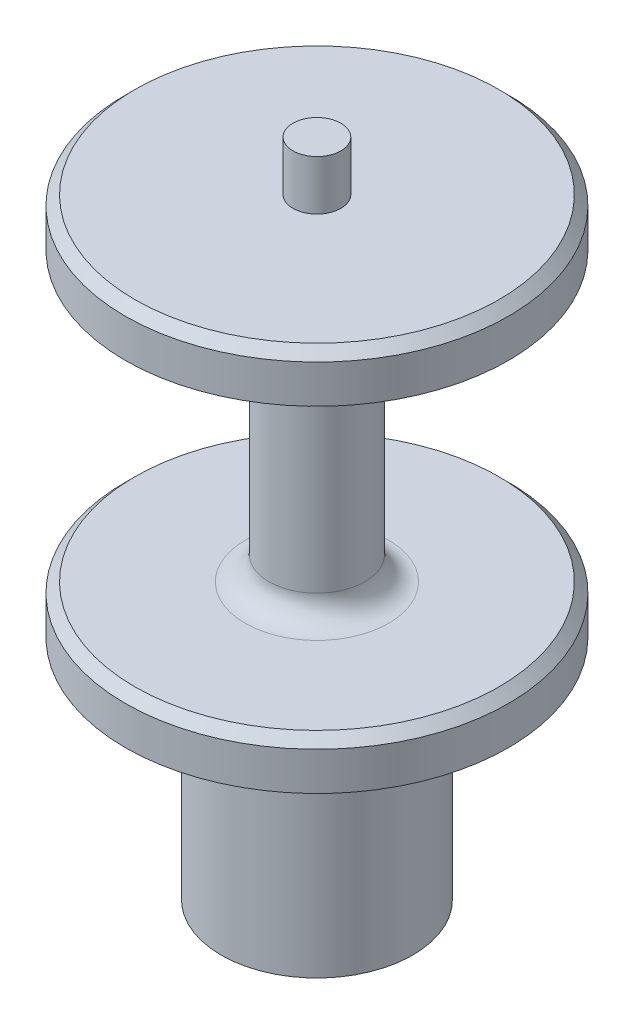
ISO-10303-21;
HEADER;
FILE_DESCRIPTION(('STEP AP214'),'2;1');
FILE_NAME('part.step','',(''),(''),'','','');
FILE_SCHEMA(('AUTOMOTIVE_DESIGN { 1 0 10303 214 1 1 1 1 }'));
ENDSEC;
DATA;
#1=APPLICATION_CONTEXT('core data for automotive mechanical design processes');
#2=APPLICATION_PROTOCOL_DEFINITION('international standard','automotive_design',2000,#1);
#3=PRODUCT_CONTEXT('',#1,'mechanical');
#4=PRODUCT('Part','Part','',(#3));
#5=PRODUCT_RELATED_PRODUCT_CATEGORY('part','',(#4));
#6=PRODUCT_DEFINITION_FORMATION('','',#4);
#7=PRODUCT_DEFINITION_CONTEXT('part definition',#1,'design');
#8=PRODUCT_DEFINITION('design','',#6,#7);
#9=PRODUCT_DEFINITION_SHAPE('','',#8);
#10=(LENGTH_UNIT() NAMED_UNIT(*) SI_UNIT(.MILLI.,.METRE.));
#11=(NAMED_UNIT(*) PLANE_ANGLE_UNIT() SI_UNIT($,.RADIAN.));
#12=(NAMED_UNIT(*) SI_UNIT($,.STERADIAN.) SOLID_ANGLE_UNIT());
#13=UNCERTAINTY_MEASURE_WITH_UNIT(LENGTH_MEASURE(1.E-05),#10,'distance_accuracy_value','');
#14=(GEOMETRIC_REPRESENTATION_CONTEXT(3) GLOBAL_UNCERTAINTY_ASSIGNED_CONTEXT((#13)) GLOBAL_UNIT_ASSIGNED_CONTEXT((#10,
#11,#12)) REPRESENTATION_CONTEXT('',''));
#15=CARTESIAN_POINT('',(0.,0.,0.));
#16=DIRECTION('',(0.,0.,1.));
#17=DIRECTION('',(1.,0.,0.));
#18=AXIS2_PLACEMENT_3D('',#15,#16,#17);
#19=CARTESIAN_POINT('',(0.,80.9625,0.));
#20=DIRECTION('',(0.,-1.,0.));
#21=DIRECTION('',(0.,0.,-1.));
#22=AXIS2_PLACEMENT_3D('',#19,#20,#21);
#23=CYLINDRICAL_SURFACE('',#22,25.4);
#24=CARTESIAN_POINT('',(0.,35.2425,0.));
#25=DIRECTION('',(0.,1.,0.));
#26=DIRECTION('',(0.,0.,1.));
#27=AXIS2_PLACEMENT_3D('',#24,#25,#26);
#28=CIRCLE('',#27,25.4);
#29=CARTESIAN_POINT('',(0.,35.2425,25.4));
#30=VERTEX_POINT('',#29);
#31=EDGE_CURVE('E11',#30,#30,#28,.F.);
#32=ORIENTED_EDGE('',*,*,#31,.T.);
#33=EDGE_LOOP('',(#32));
#34=FACE_BOUND('',#33,.T.);
#35=CARTESIAN_POINT('',(0.,30.1625,0.));
#36=DIRECTION('',(0.,1.,0.));
#37=DIRECTION('',(0.,0.,1.));
#38=AXIS2_PLACEMENT_3D('',#35,#36,#37);
#39=CIRCLE('',#38,25.4);
#40=CARTESIAN_POINT('',(0.,30.1625,25.4));
#41=VERTEX_POINT('',#40);
#42=EDGE_CURVE('E297',#41,#41,#39,.T.);
#43=ORIENTED_EDGE('',*,*,#42,.T.);
#44=EDGE_LOOP('',(#43));
#45=FACE_BOUND('',#44,.T.);
#46=ADVANCED_FACE('F35',(#34,#45),#23,.T.);
#47=CARTESIAN_POINT('',(0.,0.,0.));
#48=DIRECTION('',(0.,1.,0.));
#49=DIRECTION('',(0.,0.,1.));
#50=AXIS2_PLACEMENT_3D('',#47,#48,#49);
#51=PLANE('',#50);
#52=CARTESIAN_POINT('',(0.,0.,0.));
#53=DIRECTION('',(0.,1.,0.));
#54=DIRECTION('',(0.,0.,1.));
#55=AXIS2_PLACEMENT_3D('',#52,#53,#54);
#56=CIRCLE('',#55,12.7);
#57=CARTESIAN_POINT('',(0.,0.,12.7));
#58=VERTEX_POINT('',#57);
#59=EDGE_CURVE('E341',#58,#58,#56,.T.);
#60=ORIENTED_EDGE('',*,*,#59,.F.);
#61=EDGE_LOOP('',(#60));
#62=FACE_BOUND('',#61,.T.);
#63=DIRECTION('',(0.707106781186548,0.,0.707106781186547));
#64=VECTOR('',#63,1.);
#65=CARTESIAN_POINT('',(-4.94974746830584,0.,4.94974746830584));
#66=LINE('',#65,#64);
#67=CARTESIAN_POINT('',(-8.77696292147802,0.,1.12253201513365));
#68=VERTEX_POINT('',#67);
#69=CARTESIAN_POINT('',(-7.,0.,2.89949493661167));
#70=VERTEX_POINT('',#69);
#71=EDGE_CURVE('E50',#68,#70,#66,.T.);
#72=ORIENTED_EDGE('',*,*,#71,.T.);
#73=DIRECTION('',(0.,0.,1.));
#74=VECTOR('',#73,1.);
#75=CARTESIAN_POINT('',(-7.,0.,0.));
#76=LINE('',#75,#74);
#77=CARTESIAN_POINT('',(-7.,0.,5.4125));
#78=VERTEX_POINT('',#77);
#79=EDGE_CURVE('E136',#70,#78,#76,.T.);
#80=ORIENTED_EDGE('',*,*,#79,.T.);
#81=CARTESIAN_POINT('',(-5.4125,0.,5.4125));
#82=DIRECTION('',(0.,-1.,0.));
#83=DIRECTION('',(0.,0.,-1.));
#84=AXIS2_PLACEMENT_3D('',#81,#82,#83);
#85=CIRCLE('',#84,1.5875);
#86=CARTESIAN_POINT('',(-5.4125,0.,7.));
#87=VERTEX_POINT('',#86);
#88=EDGE_CURVE('E291',#87,#78,#85,.T.);
#89=ORIENTED_EDGE('',*,*,#88,.F.);
#90=DIRECTION('',(1.,0.,0.));
#91=VECTOR('',#90,1.);
#92=CARTESIAN_POINT('',(0.,0.,7.));
#93=LINE('',#92,#91);
#94=CARTESIAN_POINT('',(-2.89949493661167,0.,7.));
#95=VERTEX_POINT('',#94);
#96=EDGE_CURVE('E208',#87,#95,#93,.T.);
#97=ORIENTED_EDGE('',*,*,#96,.T.);
#98=DIRECTION('',(0.707106781186548,0.,0.707106781186547));
#99=VECTOR('',#98,1.);
#100=CARTESIAN_POINT('',(-4.94974746830584,0.,4.94974746830584));
#101=LINE('',#100,#99);
#102=CARTESIAN_POINT('',(-1.12253201513365,0.,8.77696292147802));
#103=VERTEX_POINT('',#102);
#104=EDGE_CURVE('E287',#95,#103,#101,.T.);
#105=ORIENTED_EDGE('',*,*,#104,.T.);
#106=CARTESIAN_POINT('',(0.,0.,7.65443090634438));
#107=DIRECTION('',(0.,-1.,0.));
#108=DIRECTION('',(0.,0.,-1.));
#109=AXIS2_PLACEMENT_3D('',#106,#107,#108);
#110=CIRCLE('',#109,1.5875);
#111=CARTESIAN_POINT('',(1.12253201513365,0.,8.77696292147801));
#112=VERTEX_POINT('',#111);
#113=EDGE_CURVE('E284',#112,#103,#110,.T.);
#114=ORIENTED_EDGE('',*,*,#113,.F.);
#115=DIRECTION('',(0.707106781186548,0.,-0.707106781186548));
#116=VECTOR('',#115,1.);
#117=CARTESIAN_POINT('',(4.94974746830583,0.,4.94974746830583));
#118=LINE('',#117,#116);
#119=CARTESIAN_POINT('',(2.89949493661166,0.,7.));
#120=VERTEX_POINT('',#119);
#121=EDGE_CURVE('E281',#112,#120,#118,.T.);
#122=ORIENTED_EDGE('',*,*,#121,.T.);
#123=DIRECTION('',(1.,0.,0.));
#124=VECTOR('',#123,1.);
#125=CARTESIAN_POINT('',(0.,0.,7.));
#126=LINE('',#125,#124);
#127=CARTESIAN_POINT('',(5.4125,0.,7.));
#128=VERTEX_POINT('',#127);
#129=EDGE_CURVE('E278',#120,#128,#126,.T.);
#130=ORIENTED_EDGE('',*,*,#129,.T.);
#131=CARTESIAN_POINT('',(5.4125,0.,5.4125));
#132=DIRECTION('',(0.,-1.,0.));
#133=DIRECTION('',(0.,0.,-1.));
#134=AXIS2_PLACEMENT_3D('',#131,#132,#133);
#135=CIRCLE('',#134,1.5875);
#136=CARTESIAN_POINT('',(7.,0.,5.4125));
#137=VERTEX_POINT('',#136);
#138=EDGE_CURVE('E275',#137,#128,#135,.T.);
#139=ORIENTED_EDGE('',*,*,#138,.F.);
#140=DIRECTION('',(0.,0.,1.));
#141=VECTOR('',#140,1.);
#142=CARTESIAN_POINT('',(7.,0.,0.));
#143=LINE('',#142,#141);
#144=CARTESIAN_POINT('',(7.,0.,2.89949493661167));
#145=VERTEX_POINT('',#144);
#146=EDGE_CURVE('E272',#145,#137,#143,.T.);
#147=ORIENTED_EDGE('',*,*,#146,.F.);
#148=DIRECTION('',(0.707106781186548,0.,-0.707106781186548));
#149=VECTOR('',#148,1.);
#150=CARTESIAN_POINT('',(4.94974746830583,0.,4.94974746830583));
#151=LINE('',#150,#149);
#152=CARTESIAN_POINT('',(8.77696292147802,0.,1.12253201513365));
#153=VERTEX_POINT('',#152);
#154=EDGE_CURVE('E269',#145,#153,#151,.T.);
#155=ORIENTED_EDGE('',*,*,#154,.T.);
#156=CARTESIAN_POINT('',(7.65443090634438,0.,0.));
#157=DIRECTION('',(0.,-1.,0.));
#158=DIRECTION('',(0.,0.,-1.));
#159=AXIS2_PLACEMENT_3D('',#156,#157,#158);
#160=CIRCLE('',#159,1.5875);
#161=CARTESIAN_POINT('',(8.77696292147801,0.,-1.12253201513364));
#162=VERTEX_POINT('',#161);
#163=EDGE_CURVE('E266',#162,#153,#160,.T.);
#164=ORIENTED_EDGE('',*,*,#163,.F.);
#165=DIRECTION('',(0.707106781186548,0.,0.707106781186548));
#166=VECTOR('',#165,1.);
#167=CARTESIAN_POINT('',(4.94974746830583,0.,-4.94974746830583));
#168=LINE('',#167,#166);
#169=CARTESIAN_POINT('',(7.,0.,-2.89949493661165));
#170=VERTEX_POINT('',#169);
#171=EDGE_CURVE('E263',#170,#162,#168,.T.);
#172=ORIENTED_EDGE('',*,*,#171,.F.);
#173=DIRECTION('',(0.,0.,1.));
#174=VECTOR('',#173,1.);
#175=CARTESIAN_POINT('',(7.,0.,0.));
#176=LINE('',#175,#174);
#177=CARTESIAN_POINT('',(7.,0.,-5.4125));
#178=VERTEX_POINT('',#177);
#179=EDGE_CURVE('E260',#178,#170,#176,.T.);
#180=ORIENTED_EDGE('',*,*,#179,.F.);
#181=CARTESIAN_POINT('',(5.4125,0.,-5.4125));
#182=DIRECTION('',(0.,-1.,0.));
#183=DIRECTION('',(0.,0.,-1.));
#184=AXIS2_PLACEMENT_3D('',#181,#182,#183);
#185=CIRCLE('',#184,1.5875);
#186=CARTESIAN_POINT('',(5.4125,0.,-7.));
#187=VERTEX_POINT('',#186);
#188=EDGE_CURVE('E257',#187,#178,#185,.T.);
#189=ORIENTED_EDGE('',*,*,#188,.F.);
#190=DIRECTION('',(1.,0.,0.));
#191=VECTOR('',#190,1.);
#192=CARTESIAN_POINT('',(0.,0.,-7.));
#193=LINE('',#192,#191);
#194=CARTESIAN_POINT('',(2.89949493661166,0.,-7.));
#195=VERTEX_POINT('',#194);
#196=EDGE_CURVE('E254',#195,#187,#193,.T.);
#197=ORIENTED_EDGE('',*,*,#196,.F.);
#198=DIRECTION('',(0.707106781186548,0.,0.707106781186548));
#199=VECTOR('',#198,1.);
#200=CARTESIAN_POINT('',(4.94974746830583,0.,-4.94974746830583));
#201=LINE('',#200,#199);
#202=CARTESIAN_POINT('',(1.12253201513364,0.,-8.77696292147802));
#203=VERTEX_POINT('',#202);
#204=EDGE_CURVE('E251',#203,#195,#201,.T.);
#205=ORIENTED_EDGE('',*,*,#204,.F.);
#206=CARTESIAN_POINT('',(0.,0.,-7.65443090634438));
#207=DIRECTION('',(0.,-1.,0.));
#208=DIRECTION('',(0.,0.,-1.));
#209=AXIS2_PLACEMENT_3D('',#206,#207,#208);
#210=CIRCLE('',#209,1.5875);
#211=CARTESIAN_POINT('',(-1.12253201513365,0.,-8.77696292147802));
#212=VERTEX_POINT('',#211);
#213=EDGE_CURVE('E248',#212,#203,#210,.T.);
#214=ORIENTED_EDGE('',*,*,#213,.F.);
#215=DIRECTION('',(0.707106781186547,0.,-0.707106781186548));
#216=VECTOR('',#215,1.);
#217=CARTESIAN_POINT('',(-4.94974746830583,0.,-4.94974746830583));
#218=LINE('',#217,#216);
#219=CARTESIAN_POINT('',(-2.89949493661167,0.,-7.));
#220=VERTEX_POINT('',#219);
#221=EDGE_CURVE('E245',#220,#212,#218,.T.);
#222=ORIENTED_EDGE('',*,*,#221,.F.);
#223=DIRECTION('',(1.,0.,0.));
#224=VECTOR('',#223,1.);
#225=CARTESIAN_POINT('',(0.,0.,-7.));
#226=LINE('',#225,#224);
#227=CARTESIAN_POINT('',(-5.4125,0.,-7.));
#228=VERTEX_POINT('',#227);
#229=EDGE_CURVE('E242',#228,#220,#226,.T.);
#230=ORIENTED_EDGE('',*,*,#229,.F.);
#231=CARTESIAN_POINT('',(-5.4125,0.,-5.4125));
#232=DIRECTION('',(0.,-1.,0.));
#233=DIRECTION('',(0.,0.,-1.));
#234=AXIS2_PLACEMENT_3D('',#231,#232,#233);
#235=CIRCLE('',#234,1.5875);
#236=CARTESIAN_POINT('',(-7.,0.,-5.4125));
#237=VERTEX_POINT('',#236);
#238=EDGE_CURVE('E239',#237,#228,#235,.T.);
#239=ORIENTED_EDGE('',*,*,#238,.F.);
#240=DIRECTION('',(0.,0.,1.));
#241=VECTOR('',#240,1.);
#242=CARTESIAN_POINT('',(-7.,0.,0.));
#243=LINE('',#242,#241);
#244=CARTESIAN_POINT('',(-7.,0.,-2.89949493661167));
#245=VERTEX_POINT('',#244);
#246=EDGE_CURVE('E236',#237,#245,#243,.T.);
#247=ORIENTED_EDGE('',*,*,#246,.T.);
#248=DIRECTION('',(0.707106781186547,0.,-0.707106781186548));
#249=VECTOR('',#248,1.);
#250=CARTESIAN_POINT('',(-4.94974746830583,0.,-4.94974746830583));
#251=LINE('',#250,#249);
#252=CARTESIAN_POINT('',(-8.77696292147803,0.,-1.12253201513364));
#253=VERTEX_POINT('',#252);
#254=EDGE_CURVE('E233',#253,#245,#251,.T.);
#255=ORIENTED_EDGE('',*,*,#254,.F.);
#256=CARTESIAN_POINT('',(-7.65443090634438,0.,0.));
#257=DIRECTION('',(0.,-1.,0.));
#258=DIRECTION('',(0.,0.,-1.));
#259=AXIS2_PLACEMENT_3D('',#256,#257,#258);
#260=CIRCLE('',#259,1.5875);
#261=EDGE_CURVE('E229',#68,#253,#260,.T.);
#262=ORIENTED_EDGE('',*,*,#261,.F.);
#263=EDGE_LOOP('',(#72,#80,#89,#97,#105,#114,#122,#130,#139,#147,#155,#164,#172,#180,#189,#197,
#205,#214,#222,#230,#239,#247,#255,#262));
#264=FACE_BOUND('',#263,.T.);
#265=ADVANCED_FACE('F380',(#62,#264),#51,.F.);
#266=CARTESIAN_POINT('',(0.,30.1625,0.));
#267=DIRECTION('',(0.,-1.,0.));
#268=DIRECTION('',(0.,0.,-1.));
#269=AXIS2_PLACEMENT_3D('',#266,#267,#268);
#270=CYLINDRICAL_SURFACE('',#269,12.7);
#271=CARTESIAN_POINT('',(0.,30.1625,0.));
#272=DIRECTION('',(0.,1.,0.));
#273=DIRECTION('',(0.,0.,1.));
#274=AXIS2_PLACEMENT_3D('',#271,#272,#273);
#275=CIRCLE('',#274,12.7);
#276=CARTESIAN_POINT('',(0.,30.1625,12.7));
#277=VERTEX_POINT('',#276);
#278=EDGE_CURVE('E342',#277,#277,#275,.T.);
#279=ORIENTED_EDGE('',*,*,#278,.F.);
#280=EDGE_LOOP('',(#279));
#281=FACE_BOUND('',#280,.T.);
#282=ORIENTED_EDGE('',*,*,#59,.T.);
#283=EDGE_LOOP('',(#282));
#284=FACE_BOUND('',#283,.T.);
#285=ADVANCED_FACE('F387',(#281,#284),#270,.T.);
#286=CARTESIAN_POINT('',(0.,30.1625,0.));
#287=DIRECTION('',(0.,1.,0.));
#288=DIRECTION('',(0.,0.,1.));
#289=AXIS2_PLACEMENT_3D('',#286,#287,#288);
#290=PLANE('',#289);
#291=ORIENTED_EDGE('',*,*,#278,.T.);
#292=EDGE_LOOP('',(#291));
#293=FACE_BOUND('',#292,.T.);
#294=ORIENTED_EDGE('',*,*,#42,.F.);
#295=EDGE_LOOP('',(#294));
#296=FACE_BOUND('',#295,.T.);
#297=ADVANCED_FACE('F512',(#293,#296),#290,.F.);
#298=CARTESIAN_POINT('',(-4.94974746830584,11.176,4.94974746830584));
#299=DIRECTION('',(0.707106781186548,0.,-0.707106781186548));
#300=DIRECTION('',(-0.707106781186548,0.,-0.707106781186547));
#301=AXIS2_PLACEMENT_3D('',#298,#299,#300);
#302=PLANE('',#301);
#303=ORIENTED_EDGE('',*,*,#71,.F.);
#304=DIRECTION('',(0.,-1.,0.));
#305=VECTOR('',#304,1.);
#306=CARTESIAN_POINT('',(-8.77696292147802,11.176,1.12253201513365));
#307=LINE('',#306,#305);
#308=CARTESIAN_POINT('',(-8.77696292147802,11.176,1.12253201513365));
#309=VERTEX_POINT('',#308);
#310=EDGE_CURVE('E139',#309,#68,#307,.T.);
#311=ORIENTED_EDGE('',*,*,#310,.F.);
#312=DIRECTION('',(0.707106781186548,0.,0.707106781186547));
#313=VECTOR('',#312,1.);
#314=CARTESIAN_POINT('',(-4.94974746830584,11.176,4.94974746830584));
#315=LINE('',#314,#313);
#316=CARTESIAN_POINT('',(-7.,11.176,2.89949493661167));
#317=VERTEX_POINT('',#316);
#318=EDGE_CURVE('E294',#309,#317,#315,.T.);
#319=ORIENTED_EDGE('',*,*,#318,.T.);
#320=DIRECTION('',(0.,-1.,0.));
#321=VECTOR('',#320,1.);
#322=CARTESIAN_POINT('',(-7.,11.176,2.89949493661167));
#323=LINE('',#322,#321);
#324=EDGE_CURVE('E295',#317,#70,#323,.T.);
#325=ORIENTED_EDGE('',*,*,#324,.T.);
#326=EDGE_LOOP('',(#303,#311,#319,#325));
#327=FACE_BOUND('',#326,.T.);
#328=ADVANCED_FACE('F503',(#327),#302,.T.);
#329=CARTESIAN_POINT('',(-7.,11.176,0.));
#330=DIRECTION('',(1.,0.,0.));
#331=DIRECTION('',(0.,0.,-1.));
#332=AXIS2_PLACEMENT_3D('',#329,#330,#331);
#333=PLANE('',#332);
#334=ORIENTED_EDGE('',*,*,#79,.F.);
#335=ORIENTED_EDGE('',*,*,#324,.F.);
#336=DIRECTION('',(0.,0.,1.));
#337=VECTOR('',#336,1.);
#338=CARTESIAN_POINT('',(-7.,11.176,0.));
#339=LINE('',#338,#337);
#340=CARTESIAN_POINT('',(-7.,11.176,5.4125));
#341=VERTEX_POINT('',#340);
#342=EDGE_CURVE('E59',#317,#341,#339,.T.);
#343=ORIENTED_EDGE('',*,*,#342,.T.);
#344=DIRECTION('',(0.,-1.,0.));
#345=VECTOR('',#344,1.);
#346=CARTESIAN_POINT('',(-7.,11.176,5.4125));
#347=LINE('',#346,#345);
#348=EDGE_CURVE('E213',#341,#78,#347,.T.);
#349=ORIENTED_EDGE('',*,*,#348,.T.);
#350=EDGE_LOOP('',(#334,#335,#343,#349));
#351=FACE_BOUND('',#350,.T.);
#352=ADVANCED_FACE('F504',(#351),#333,.T.);
#353=CARTESIAN_POINT('',(-5.4125,11.176,5.4125));
#354=DIRECTION('',(0.,-1.,0.));
#355=DIRECTION('',(0.,0.,-1.));
#356=AXIS2_PLACEMENT_3D('',#353,#354,#355);
#357=CYLINDRICAL_SURFACE('',#356,1.5875);
#358=ORIENTED_EDGE('',*,*,#88,.T.);
#359=ORIENTED_EDGE('',*,*,#348,.F.);
#360=CARTESIAN_POINT('',(-5.4125,11.176,5.4125));
#361=DIRECTION('',(0.,-1.,0.));
#362=DIRECTION('',(0.,0.,-1.));
#363=AXIS2_PLACEMENT_3D('',#360,#361,#362);
#364=CIRCLE('',#363,1.5875);
#365=CARTESIAN_POINT('',(-5.4125,11.176,7.));
#366=VERTEX_POINT('',#365);
#367=EDGE_CURVE('E218',#366,#341,#364,.T.);
#368=ORIENTED_EDGE('',*,*,#367,.F.);
#369=DIRECTION('',(0.,-1.,0.));
#370=VECTOR('',#369,1.);
#371=CARTESIAN_POINT('',(-5.4125,11.176,7.));
#372=LINE('',#371,#370);
#373=EDGE_CURVE('E202',#366,#87,#372,.T.);
#374=ORIENTED_EDGE('',*,*,#373,.T.);
#375=EDGE_LOOP('',(#358,#359,#368,#374));
#376=FACE_BOUND('',#375,.T.);
#377=ADVANCED_FACE('F223',(#376),#357,.F.);
#378=CARTESIAN_POINT('',(0.,11.176,7.));
#379=DIRECTION('',(0.,0.,-1.));
#380=DIRECTION('',(-1.,0.,0.));
#381=AXIS2_PLACEMENT_3D('',#378,#379,#380);
#382=PLANE('',#381);
#383=ORIENTED_EDGE('',*,*,#96,.F.);
#384=ORIENTED_EDGE('',*,*,#373,.F.);
#385=DIRECTION('',(1.,0.,0.));
#386=VECTOR('',#385,1.);
#387=CARTESIAN_POINT('',(0.,11.176,7.));
#388=LINE('',#387,#386);
#389=CARTESIAN_POINT('',(-2.89949493661167,11.176,7.));
#390=VERTEX_POINT('',#389);
#391=EDGE_CURVE('E205',#366,#390,#388,.T.);
#392=ORIENTED_EDGE('',*,*,#391,.T.);
#393=DIRECTION('',(0.,-1.,0.));
#394=VECTOR('',#393,1.);
#395=CARTESIAN_POINT('',(-2.89949493661167,11.176,7.));
#396=LINE('',#395,#394);
#397=EDGE_CURVE('E214',#390,#95,#396,.T.);
#398=ORIENTED_EDGE('',*,*,#397,.T.);
#399=EDGE_LOOP('',(#383,#384,#392,#398));
#400=FACE_BOUND('',#399,.T.);
#401=ADVANCED_FACE('F204',(#400),#382,.T.);
#402=CARTESIAN_POINT('',(-4.94974746830584,11.176,4.94974746830584));
#403=DIRECTION('',(0.707106781186548,0.,-0.707106781186548));
#404=DIRECTION('',(-0.707106781186548,0.,-0.707106781186547));
#405=AXIS2_PLACEMENT_3D('',#402,#403,#404);
#406=PLANE('',#405);
#407=ORIENTED_EDGE('',*,*,#104,.F.);
#408=ORIENTED_EDGE('',*,*,#397,.F.);
#409=DIRECTION('',(0.707106781186548,0.,0.707106781186547));
#410=VECTOR('',#409,1.);
#411=CARTESIAN_POINT('',(-4.94974746830584,11.176,4.94974746830584));
#412=LINE('',#411,#410);
#413=CARTESIAN_POINT('',(-1.12253201513365,11.176,8.77696292147802));
#414=VERTEX_POINT('',#413);
#415=EDGE_CURVE('E220',#390,#414,#412,.T.);
#416=ORIENTED_EDGE('',*,*,#415,.T.);
#417=DIRECTION('',(0.,-1.,0.));
#418=VECTOR('',#417,1.);
#419=CARTESIAN_POINT('',(-1.12253201513365,11.176,8.77696292147802));
#420=LINE('',#419,#418);
#421=EDGE_CURVE('E300',#414,#103,#420,.T.);
#422=ORIENTED_EDGE('',*,*,#421,.T.);
#423=EDGE_LOOP('',(#407,#408,#416,#422));
#424=FACE_BOUND('',#423,.T.);
#425=ADVANCED_FACE('F479',(#424),#406,.T.);
#426=CARTESIAN_POINT('',(0.,11.176,7.65443090634438));
#427=DIRECTION('',(0.,-1.,0.));
#428=DIRECTION('',(0.,0.,-1.));
#429=AXIS2_PLACEMENT_3D('',#426,#427,#428);
#430=CYLINDRICAL_SURFACE('',#429,1.5875);
#431=ORIENTED_EDGE('',*,*,#113,.T.);
#432=ORIENTED_EDGE('',*,*,#421,.F.);
#433=CARTESIAN_POINT('',(0.,11.176,7.65443090634438));
#434=DIRECTION('',(0.,-1.,0.));
#435=DIRECTION('',(0.,0.,-1.));
#436=AXIS2_PLACEMENT_3D('',#433,#434,#435);
#437=CIRCLE('',#436,1.5875);
#438=CARTESIAN_POINT('',(1.12253201513365,11.176,8.77696292147801));
#439=VERTEX_POINT('',#438);
#440=EDGE_CURVE('E475',#439,#414,#437,.T.);
#441=ORIENTED_EDGE('',*,*,#440,.F.);
#442=DIRECTION('',(0.,-1.,0.));
#443=VECTOR('',#442,1.);
#444=CARTESIAN_POINT('',(1.12253201513365,11.176,8.77696292147801));
#445=LINE('',#444,#443);
#446=EDGE_CURVE('E302',#439,#112,#445,.T.);
#447=ORIENTED_EDGE('',*,*,#446,.T.);
#448=EDGE_LOOP('',(#431,#432,#441,#447));
#449=FACE_BOUND('',#448,.T.);
#450=ADVANCED_FACE('F482',(#449),#430,.F.);
#451=CARTESIAN_POINT('',(4.94974746830583,11.176,4.94974746830583));
#452=DIRECTION('',(-0.707106781186548,0.,-0.707106781186548));
#453=DIRECTION('',(-0.707106781186548,0.,0.707106781186548));
#454=AXIS2_PLACEMENT_3D('',#451,#452,#453);
#455=PLANE('',#454);
#456=ORIENTED_EDGE('',*,*,#121,.F.);
#457=ORIENTED_EDGE('',*,*,#446,.F.);
#458=DIRECTION('',(0.707106781186548,0.,-0.707106781186548));
#459=VECTOR('',#458,1.);
#460=CARTESIAN_POINT('',(4.94974746830583,11.176,4.94974746830583));
#461=LINE('',#460,#459);
#462=CARTESIAN_POINT('',(2.89949493661166,11.176,7.));
#463=VERTEX_POINT('',#462);
#464=EDGE_CURVE('E473',#439,#463,#461,.T.);
#465=ORIENTED_EDGE('',*,*,#464,.T.);
#466=DIRECTION('',(0.,-1.,0.));
#467=VECTOR('',#466,1.);
#468=CARTESIAN_POINT('',(2.89949493661166,11.176,7.));
#469=LINE('',#468,#467);
#470=EDGE_CURVE('E304',#463,#120,#469,.T.);
#471=ORIENTED_EDGE('',*,*,#470,.T.);
#472=EDGE_LOOP('',(#456,#457,#465,#471));
#473=FACE_BOUND('',#472,.T.);
#474=ADVANCED_FACE('F489',(#473),#455,.T.);
#475=CARTESIAN_POINT('',(0.,11.176,7.));
#476=DIRECTION('',(0.,0.,-1.));
#477=DIRECTION('',(-1.,0.,0.));
#478=AXIS2_PLACEMENT_3D('',#475,#476,#477);
#479=PLANE('',#478);
#480=ORIENTED_EDGE('',*,*,#129,.F.);
#481=ORIENTED_EDGE('',*,*,#470,.F.);
#482=DIRECTION('',(1.,0.,0.));
#483=VECTOR('',#482,1.);
#484=CARTESIAN_POINT('',(0.,11.176,7.));
#485=LINE('',#484,#483);
#486=CARTESIAN_POINT('',(5.4125,11.176,7.));
#487=VERTEX_POINT('',#486);
#488=EDGE_CURVE('E471',#463,#487,#485,.T.);
#489=ORIENTED_EDGE('',*,*,#488,.T.);
#490=DIRECTION('',(0.,-1.,0.));
#491=VECTOR('',#490,1.);
#492=CARTESIAN_POINT('',(5.4125,11.176,7.));
#493=LINE('',#492,#491);
#494=EDGE_CURVE('E306',#487,#128,#493,.T.);
#495=ORIENTED_EDGE('',*,*,#494,.T.);
#496=EDGE_LOOP('',(#480,#481,#489,#495));
#497=FACE_BOUND('',#496,.T.);
#498=ADVANCED_FACE('F492',(#497),#479,.T.);
#499=CARTESIAN_POINT('',(5.4125,11.176,5.4125));
#500=DIRECTION('',(0.,-1.,0.));
#501=DIRECTION('',(0.,0.,-1.));
#502=AXIS2_PLACEMENT_3D('',#499,#500,#501);
#503=CYLINDRICAL_SURFACE('',#502,1.5875);
#504=ORIENTED_EDGE('',*,*,#138,.T.);
#505=ORIENTED_EDGE('',*,*,#494,.F.);
#506=CARTESIAN_POINT('',(5.4125,11.176,5.4125));
#507=DIRECTION('',(0.,-1.,0.));
#508=DIRECTION('',(0.,0.,-1.));
#509=AXIS2_PLACEMENT_3D('',#506,#507,#508);
#510=CIRCLE('',#509,1.5875);
#511=CARTESIAN_POINT('',(7.,11.176,5.4125));
#512=VERTEX_POINT('',#511);
#513=EDGE_CURVE('E468',#512,#487,#510,.T.);
#514=ORIENTED_EDGE('',*,*,#513,.F.);
#515=DIRECTION('',(0.,-1.,0.));
#516=VECTOR('',#515,1.);
#517=CARTESIAN_POINT('',(7.,11.176,5.4125));
#518=LINE('',#517,#516);
#519=EDGE_CURVE('E308',#512,#137,#518,.T.);
#520=ORIENTED_EDGE('',*,*,#519,.T.);
#521=EDGE_LOOP('',(#504,#505,#514,#520));
#522=FACE_BOUND('',#521,.T.);
#523=ADVANCED_FACE('F527',(#522),#503,.F.);
#524=CARTESIAN_POINT('',(7.,11.176,0.));
#525=DIRECTION('',(1.,0.,0.));
#526=DIRECTION('',(0.,0.,-1.));
#527=AXIS2_PLACEMENT_3D('',#524,#525,#526);
#528=PLANE('',#527);
#529=ORIENTED_EDGE('',*,*,#146,.T.);
#530=ORIENTED_EDGE('',*,*,#519,.F.);
#531=DIRECTION('',(0.,0.,1.));
#532=VECTOR('',#531,1.);
#533=CARTESIAN_POINT('',(7.,11.176,0.));
#534=LINE('',#533,#532);
#535=CARTESIAN_POINT('',(7.,11.176,2.89949493661167));
#536=VERTEX_POINT('',#535);
#537=EDGE_CURVE('E465',#536,#512,#534,.T.);
#538=ORIENTED_EDGE('',*,*,#537,.F.);
#539=DIRECTION('',(0.,-1.,0.));
#540=VECTOR('',#539,1.);
#541=CARTESIAN_POINT('',(7.,11.176,2.89949493661167));
#542=LINE('',#541,#540);
#543=EDGE_CURVE('E310',#536,#145,#542,.T.);
#544=ORIENTED_EDGE('',*,*,#543,.T.);
#545=EDGE_LOOP('',(#529,#530,#538,#544));
#546=FACE_BOUND('',#545,.T.);
#547=ADVANCED_FACE('F530',(#546),#528,.F.);
#548=CARTESIAN_POINT('',(4.94974746830583,11.176,4.94974746830583));
#549=DIRECTION('',(-0.707106781186548,0.,-0.707106781186548));
#550=DIRECTION('',(-0.707106781186548,0.,0.707106781186548));
#551=AXIS2_PLACEMENT_3D('',#548,#549,#550);
#552=PLANE('',#551);
#553=ORIENTED_EDGE('',*,*,#154,.F.);
#554=ORIENTED_EDGE('',*,*,#543,.F.);
#555=DIRECTION('',(0.707106781186548,0.,-0.707106781186548));
#556=VECTOR('',#555,1.);
#557=CARTESIAN_POINT('',(4.94974746830583,11.176,4.94974746830583));
#558=LINE('',#557,#556);
#559=CARTESIAN_POINT('',(8.77696292147802,11.176,1.12253201513365));
#560=VERTEX_POINT('',#559);
#561=EDGE_CURVE('E463',#536,#560,#558,.T.);
#562=ORIENTED_EDGE('',*,*,#561,.T.);
#563=DIRECTION('',(0.,-1.,0.));
#564=VECTOR('',#563,1.);
#565=CARTESIAN_POINT('',(8.77696292147802,11.176,1.12253201513365));
#566=LINE('',#565,#564);
#567=EDGE_CURVE('E312',#560,#153,#566,.T.);
#568=ORIENTED_EDGE('',*,*,#567,.T.);
#569=EDGE_LOOP('',(#553,#554,#562,#568));
#570=FACE_BOUND('',#569,.T.);
#571=ADVANCED_FACE('F534',(#570),#552,.T.);
#572=CARTESIAN_POINT('',(7.65443090634438,11.176,0.));
#573=DIRECTION('',(0.,-1.,0.));
#574=DIRECTION('',(0.,0.,-1.));
#575=AXIS2_PLACEMENT_3D('',#572,#573,#574);
#576=CYLINDRICAL_SURFACE('',#575,1.5875);
#577=ORIENTED_EDGE('',*,*,#163,.T.);
#578=ORIENTED_EDGE('',*,*,#567,.F.);
#579=CARTESIAN_POINT('',(7.65443090634438,11.176,0.));
#580=DIRECTION('',(0.,-1.,0.));
#581=DIRECTION('',(0.,0.,-1.));
#582=AXIS2_PLACEMENT_3D('',#579,#580,#581);
#583=CIRCLE('',#582,1.5875);
#584=CARTESIAN_POINT('',(8.77696292147801,11.176,-1.12253201513364));
#585=VERTEX_POINT('',#584);
#586=EDGE_CURVE('E460',#585,#560,#583,.T.);
#587=ORIENTED_EDGE('',*,*,#586,.F.);
#588=DIRECTION('',(0.,-1.,0.));
#589=VECTOR('',#588,1.);
#590=CARTESIAN_POINT('',(8.77696292147801,11.176,-1.12253201513364));
#591=LINE('',#590,#589);
#592=EDGE_CURVE('E314',#585,#162,#591,.T.);
#593=ORIENTED_EDGE('',*,*,#592,.T.);
#594=EDGE_LOOP('',(#577,#578,#587,#593));
#595=FACE_BOUND('',#594,.T.);
#596=ADVANCED_FACE('F538',(#595),#576,.F.);
#597=CARTESIAN_POINT('',(4.94974746830583,11.176,-4.94974746830583));
#598=DIRECTION('',(0.707106781186548,0.,-0.707106781186548));
#599=DIRECTION('',(-0.707106781186548,0.,-0.707106781186548));
#600=AXIS2_PLACEMENT_3D('',#597,#598,#599);
#601=PLANE('',#600);
#602=ORIENTED_EDGE('',*,*,#171,.T.);
#603=ORIENTED_EDGE('',*,*,#592,.F.);
#604=DIRECTION('',(0.707106781186548,0.,0.707106781186548));
#605=VECTOR('',#604,1.);
#606=CARTESIAN_POINT('',(4.94974746830583,11.176,-4.94974746830583));
#607=LINE('',#606,#605);
#608=CARTESIAN_POINT('',(7.,11.176,-2.89949493661165));
#609=VERTEX_POINT('',#608);
#610=EDGE_CURVE('E457',#609,#585,#607,.T.);
#611=ORIENTED_EDGE('',*,*,#610,.F.);
#612=DIRECTION('',(0.,-1.,0.));
#613=VECTOR('',#612,1.);
#614=CARTESIAN_POINT('',(7.,11.176,-2.89949493661165));
#615=LINE('',#614,#613);
#616=EDGE_CURVE('E316',#609,#170,#615,.T.);
#617=ORIENTED_EDGE('',*,*,#616,.T.);
#618=EDGE_LOOP('',(#602,#603,#611,#617));
#619=FACE_BOUND('',#618,.T.);
#620=ADVANCED_FACE('F542',(#619),#601,.F.);
#621=CARTESIAN_POINT('',(7.,11.176,0.));
#622=DIRECTION('',(1.,0.,0.));
#623=DIRECTION('',(0.,0.,-1.));
#624=AXIS2_PLACEMENT_3D('',#621,#622,#623);
#625=PLANE('',#624);
#626=ORIENTED_EDGE('',*,*,#179,.T.);
#627=ORIENTED_EDGE('',*,*,#616,.F.);
#628=DIRECTION('',(0.,0.,1.));
#629=VECTOR('',#628,1.);
#630=CARTESIAN_POINT('',(7.,11.176,0.));
#631=LINE('',#630,#629);
#632=CARTESIAN_POINT('',(7.,11.176,-5.4125));
#633=VERTEX_POINT('',#632);
#634=EDGE_CURVE('E454',#633,#609,#631,.T.);
#635=ORIENTED_EDGE('',*,*,#634,.F.);
#636=DIRECTION('',(0.,-1.,0.));
#637=VECTOR('',#636,1.);
#638=CARTESIAN_POINT('',(7.,11.176,-5.4125));
#639=LINE('',#638,#637);
#640=EDGE_CURVE('E318',#633,#178,#639,.T.);
#641=ORIENTED_EDGE('',*,*,#640,.T.);
#642=EDGE_LOOP('',(#626,#627,#635,#641));
#643=FACE_BOUND('',#642,.T.);
#644=ADVANCED_FACE('F546',(#643),#625,.F.);
#645=CARTESIAN_POINT('',(5.4125,11.176,-5.4125));
#646=DIRECTION('',(0.,-1.,0.));
#647=DIRECTION('',(0.,0.,-1.));
#648=AXIS2_PLACEMENT_3D('',#645,#646,#647);
#649=CYLINDRICAL_SURFACE('',#648,1.5875);
#650=ORIENTED_EDGE('',*,*,#188,.T.);
#651=ORIENTED_EDGE('',*,*,#640,.F.);
#652=CARTESIAN_POINT('',(5.4125,11.176,-5.4125));
#653=DIRECTION('',(0.,-1.,0.));
#654=DIRECTION('',(0.,0.,-1.));
#655=AXIS2_PLACEMENT_3D('',#652,#653,#654);
#656=CIRCLE('',#655,1.5875);
#657=CARTESIAN_POINT('',(5.4125,11.176,-7.));
#658=VERTEX_POINT('',#657);
#659=EDGE_CURVE('E451',#658,#633,#656,.T.);
#660=ORIENTED_EDGE('',*,*,#659,.F.);
#661=DIRECTION('',(0.,-1.,0.));
#662=VECTOR('',#661,1.);
#663=CARTESIAN_POINT('',(5.4125,11.176,-7.));
#664=LINE('',#663,#662);
#665=EDGE_CURVE('E320',#658,#187,#664,.T.);
#666=ORIENTED_EDGE('',*,*,#665,.T.);
#667=EDGE_LOOP('',(#650,#651,#660,#666));
#668=FACE_BOUND('',#667,.T.);
#669=ADVANCED_FACE('F550',(#668),#649,.F.);
#670=CARTESIAN_POINT('',(0.,11.176,-7.));
#671=DIRECTION('',(0.,0.,-1.));
#672=DIRECTION('',(-1.,0.,0.));
#673=AXIS2_PLACEMENT_3D('',#670,#671,#672);
#674=PLANE('',#673);
#675=ORIENTED_EDGE('',*,*,#196,.T.);
#676=ORIENTED_EDGE('',*,*,#665,.F.);
#677=DIRECTION('',(1.,0.,0.));
#678=VECTOR('',#677,1.);
#679=CARTESIAN_POINT('',(0.,11.176,-7.));
#680=LINE('',#679,#678);
#681=CARTESIAN_POINT('',(2.89949493661166,11.176,-7.));
#682=VERTEX_POINT('',#681);
#683=EDGE_CURVE('E448',#682,#658,#680,.T.);
#684=ORIENTED_EDGE('',*,*,#683,.F.);
#685=DIRECTION('',(0.,-1.,0.));
#686=VECTOR('',#685,1.);
#687=CARTESIAN_POINT('',(2.89949493661166,11.176,-7.));
#688=LINE('',#687,#686);
#689=EDGE_CURVE('E322',#682,#195,#688,.T.);
#690=ORIENTED_EDGE('',*,*,#689,.T.);
#691=EDGE_LOOP('',(#675,#676,#684,#690));
#692=FACE_BOUND('',#691,.T.);
#693=ADVANCED_FACE('F554',(#692),#674,.F.);
#694=CARTESIAN_POINT('',(4.94974746830583,11.176,-4.94974746830583));
#695=DIRECTION('',(0.707106781186548,0.,-0.707106781186548));
#696=DIRECTION('',(-0.707106781186548,0.,-0.707106781186548));
#697=AXIS2_PLACEMENT_3D('',#694,#695,#696);
#698=PLANE('',#697);
#699=ORIENTED_EDGE('',*,*,#204,.T.);
#700=ORIENTED_EDGE('',*,*,#689,.F.);
#701=DIRECTION('',(0.707106781186548,0.,0.707106781186548));
#702=VECTOR('',#701,1.);
#703=CARTESIAN_POINT('',(4.94974746830583,11.176,-4.94974746830583));
#704=LINE('',#703,#702);
#705=CARTESIAN_POINT('',(1.12253201513364,11.176,-8.77696292147802));
#706=VERTEX_POINT('',#705);
#707=EDGE_CURVE('E445',#706,#682,#704,.T.);
#708=ORIENTED_EDGE('',*,*,#707,.F.);
#709=DIRECTION('',(0.,-1.,0.));
#710=VECTOR('',#709,1.);
#711=CARTESIAN_POINT('',(1.12253201513364,11.176,-8.77696292147802));
#712=LINE('',#711,#710);
#713=EDGE_CURVE('E324',#706,#203,#712,.T.);
#714=ORIENTED_EDGE('',*,*,#713,.T.);
#715=EDGE_LOOP('',(#699,#700,#708,#714));
#716=FACE_BOUND('',#715,.T.);
#717=ADVANCED_FACE('F558',(#716),#698,.F.);
#718=CARTESIAN_POINT('',(0.,11.176,-7.65443090634438));
#719=DIRECTION('',(0.,-1.,0.));
#720=DIRECTION('',(0.,0.,-1.));
#721=AXIS2_PLACEMENT_3D('',#718,#719,#720);
#722=CYLINDRICAL_SURFACE('',#721,1.5875);
#723=ORIENTED_EDGE('',*,*,#213,.T.);
#724=ORIENTED_EDGE('',*,*,#713,.F.);
#725=CARTESIAN_POINT('',(0.,11.176,-7.65443090634438));
#726=DIRECTION('',(0.,-1.,0.));
#727=DIRECTION('',(0.,0.,-1.));
#728=AXIS2_PLACEMENT_3D('',#725,#726,#727);
#729=CIRCLE('',#728,1.5875);
#730=CARTESIAN_POINT('',(-1.12253201513365,11.176,-8.77696292147802));
#731=VERTEX_POINT('',#730);
#732=EDGE_CURVE('E442',#731,#706,#729,.T.);
#733=ORIENTED_EDGE('',*,*,#732,.F.);
#734=DIRECTION('',(0.,-1.,0.));
#735=VECTOR('',#734,1.);
#736=CARTESIAN_POINT('',(-1.12253201513365,11.176,-8.77696292147802));
#737=LINE('',#736,#735);
#738=EDGE_CURVE('E326',#731,#212,#737,.T.);
#739=ORIENTED_EDGE('',*,*,#738,.T.);
#740=EDGE_LOOP('',(#723,#724,#733,#739));
#741=FACE_BOUND('',#740,.T.);
#742=ADVANCED_FACE('F562',(#741),#722,.F.);
#743=CARTESIAN_POINT('',(-4.94974746830583,11.176,-4.94974746830583));
#744=DIRECTION('',(-0.707106781186548,0.,-0.707106781186548));
#745=DIRECTION('',(-0.707106781186547,0.,0.707106781186548));
#746=AXIS2_PLACEMENT_3D('',#743,#744,#745);
#747=PLANE('',#746);
#748=ORIENTED_EDGE('',*,*,#221,.T.);
#749=ORIENTED_EDGE('',*,*,#738,.F.);
#750=DIRECTION('',(0.707106781186547,0.,-0.707106781186548));
#751=VECTOR('',#750,1.);
#752=CARTESIAN_POINT('',(-4.94974746830583,11.176,-4.94974746830583));
#753=LINE('',#752,#751);
#754=CARTESIAN_POINT('',(-2.89949493661167,11.176,-7.));
#755=VERTEX_POINT('',#754);
#756=EDGE_CURVE('E439',#755,#731,#753,.T.);
#757=ORIENTED_EDGE('',*,*,#756,.F.);
#758=DIRECTION('',(0.,-1.,0.));
#759=VECTOR('',#758,1.);
#760=CARTESIAN_POINT('',(-2.89949493661167,11.176,-7.));
#761=LINE('',#760,#759);
#762=EDGE_CURVE('E328',#755,#220,#761,.T.);
#763=ORIENTED_EDGE('',*,*,#762,.T.);
#764=EDGE_LOOP('',(#748,#749,#757,#763));
#765=FACE_BOUND('',#764,.T.);
#766=ADVANCED_FACE('F566',(#765),#747,.F.);
#767=CARTESIAN_POINT('',(0.,11.176,-7.));
#768=DIRECTION('',(0.,0.,-1.));
#769=DIRECTION('',(-1.,0.,0.));
#770=AXIS2_PLACEMENT_3D('',#767,#768,#769);
#771=PLANE('',#770);
#772=ORIENTED_EDGE('',*,*,#229,.T.);
#773=ORIENTED_EDGE('',*,*,#762,.F.);
#774=DIRECTION('',(1.,0.,0.));
#775=VECTOR('',#774,1.);
#776=CARTESIAN_POINT('',(0.,11.176,-7.));
#777=LINE('',#776,#775);
#778=CARTESIAN_POINT('',(-5.4125,11.176,-7.));
#779=VERTEX_POINT('',#778);
#780=EDGE_CURVE('E436',#779,#755,#777,.T.);
#781=ORIENTED_EDGE('',*,*,#780,.F.);
#782=DIRECTION('',(0.,-1.,0.));
#783=VECTOR('',#782,1.);
#784=CARTESIAN_POINT('',(-5.4125,11.176,-7.));
#785=LINE('',#784,#783);
#786=EDGE_CURVE('E330',#779,#228,#785,.T.);
#787=ORIENTED_EDGE('',*,*,#786,.T.);
#788=EDGE_LOOP('',(#772,#773,#781,#787));
#789=FACE_BOUND('',#788,.T.);
#790=ADVANCED_FACE('F570',(#789),#771,.F.);
#791=CARTESIAN_POINT('',(-5.4125,11.176,-5.4125));
#792=DIRECTION('',(0.,-1.,0.));
#793=DIRECTION('',(0.,0.,-1.));
#794=AXIS2_PLACEMENT_3D('',#791,#792,#793);
#795=CYLINDRICAL_SURFACE('',#794,1.5875);
#796=ORIENTED_EDGE('',*,*,#238,.T.);
#797=ORIENTED_EDGE('',*,*,#786,.F.);
#798=CARTESIAN_POINT('',(-5.4125,11.176,-5.4125));
#799=DIRECTION('',(0.,-1.,0.));
#800=DIRECTION('',(0.,0.,-1.));
#801=AXIS2_PLACEMENT_3D('',#798,#799,#800);
#802=CIRCLE('',#801,1.5875);
#803=CARTESIAN_POINT('',(-7.,11.176,-5.4125));
#804=VERTEX_POINT('',#803);
#805=EDGE_CURVE('E433',#804,#779,#802,.T.);
#806=ORIENTED_EDGE('',*,*,#805,.F.);
#807=DIRECTION('',(0.,-1.,0.));
#808=VECTOR('',#807,1.);
#809=CARTESIAN_POINT('',(-7.,11.176,-5.4125));
#810=LINE('',#809,#808);
#811=EDGE_CURVE('E332',#804,#237,#810,.T.);
#812=ORIENTED_EDGE('',*,*,#811,.T.);
#813=EDGE_LOOP('',(#796,#797,#806,#812));
#814=FACE_BOUND('',#813,.T.);
#815=ADVANCED_FACE('F574',(#814),#795,.F.);
#816=CARTESIAN_POINT('',(-7.,11.176,0.));
#817=DIRECTION('',(1.,0.,0.));
#818=DIRECTION('',(0.,0.,-1.));
#819=AXIS2_PLACEMENT_3D('',#816,#817,#818);
#820=PLANE('',#819);
#821=ORIENTED_EDGE('',*,*,#246,.F.);
#822=ORIENTED_EDGE('',*,*,#811,.F.);
#823=DIRECTION('',(0.,0.,1.));
#824=VECTOR('',#823,1.);
#825=CARTESIAN_POINT('',(-7.,11.176,0.));
#826=LINE('',#825,#824);
#827=CARTESIAN_POINT('',(-7.,11.176,-2.89949493661167));
#828=VERTEX_POINT('',#827);
#829=EDGE_CURVE('E431',#804,#828,#826,.T.);
#830=ORIENTED_EDGE('',*,*,#829,.T.);
#831=DIRECTION('',(0.,-1.,0.));
#832=VECTOR('',#831,1.);
#833=CARTESIAN_POINT('',(-7.,11.176,-2.89949493661167));
#834=LINE('',#833,#832);
#835=EDGE_CURVE('E334',#828,#245,#834,.T.);
#836=ORIENTED_EDGE('',*,*,#835,.T.);
#837=EDGE_LOOP('',(#821,#822,#830,#836));
#838=FACE_BOUND('',#837,.T.);
#839=ADVANCED_FACE('F578',(#838),#820,.T.);
#840=CARTESIAN_POINT('',(-4.94974746830583,11.176,-4.94974746830583));
#841=DIRECTION('',(-0.707106781186548,0.,-0.707106781186548));
#842=DIRECTION('',(-0.707106781186547,0.,0.707106781186548));
#843=AXIS2_PLACEMENT_3D('',#840,#841,#842);
#844=PLANE('',#843);
#845=ORIENTED_EDGE('',*,*,#254,.T.);
#846=ORIENTED_EDGE('',*,*,#835,.F.);
#847=DIRECTION('',(0.707106781186547,0.,-0.707106781186548));
#848=VECTOR('',#847,1.);
#849=CARTESIAN_POINT('',(-4.94974746830583,11.176,-4.94974746830583));
#850=LINE('',#849,#848);
#851=CARTESIAN_POINT('',(-8.77696292147803,11.176,-1.12253201513364));
#852=VERTEX_POINT('',#851);
#853=EDGE_CURVE('E428',#852,#828,#850,.T.);
#854=ORIENTED_EDGE('',*,*,#853,.F.);
#855=DIRECTION('',(0.,-1.,0.));
#856=VECTOR('',#855,1.);
#857=CARTESIAN_POINT('',(-8.77696292147803,11.176,-1.12253201513364));
#858=LINE('',#857,#856);
#859=EDGE_CURVE('E336',#852,#253,#858,.T.);
#860=ORIENTED_EDGE('',*,*,#859,.T.);
#861=EDGE_LOOP('',(#845,#846,#854,#860));
#862=FACE_BOUND('',#861,.T.);
#863=ADVANCED_FACE('F582',(#862),#844,.F.);
#864=CARTESIAN_POINT('',(-7.65443090634438,11.176,0.));
#865=DIRECTION('',(0.,-1.,0.));
#866=DIRECTION('',(0.,0.,-1.));
#867=AXIS2_PLACEMENT_3D('',#864,#865,#866);
#868=CYLINDRICAL_SURFACE('',#867,1.5875);
#869=ORIENTED_EDGE('',*,*,#261,.T.);
#870=ORIENTED_EDGE('',*,*,#859,.F.);
#871=CARTESIAN_POINT('',(-7.65443090634438,11.176,0.));
#872=DIRECTION('',(0.,-1.,0.));
#873=DIRECTION('',(0.,0.,-1.));
#874=AXIS2_PLACEMENT_3D('',#871,#872,#873);
#875=CIRCLE('',#874,1.5875);
#876=EDGE_CURVE('E425',#309,#852,#875,.T.);
#877=ORIENTED_EDGE('',*,*,#876,.F.);
#878=ORIENTED_EDGE('',*,*,#310,.T.);
#879=EDGE_LOOP('',(#869,#870,#877,#878));
#880=FACE_BOUND('',#879,.T.);
#881=ADVANCED_FACE('F499',(#880),#868,.F.);
#882=CARTESIAN_POINT('',(0.,11.176,0.));
#883=DIRECTION('',(0.,-1.,0.));
#884=DIRECTION('',(0.,0.,-1.));
#885=AXIS2_PLACEMENT_3D('',#882,#883,#884);
#886=PLANE('',#885);
#887=CARTESIAN_POINT('',(0.,11.176,0.));
#888=DIRECTION('',(0.,-1.,0.));
#889=DIRECTION('',(0.,0.,-1.));
#890=AXIS2_PLACEMENT_3D('',#887,#888,#889);
#891=CIRCLE('',#890,6.);
#892=CARTESIAN_POINT('',(0.,11.176,-6.));
#893=VERTEX_POINT('',#892);
#894=EDGE_CURVE('E418',#893,#893,#891,.T.);
#895=ORIENTED_EDGE('',*,*,#894,.F.);
#896=EDGE_LOOP('',(#895));
#897=FACE_BOUND('',#896,.T.);
#898=ORIENTED_EDGE('',*,*,#318,.F.);
#899=ORIENTED_EDGE('',*,*,#876,.T.);
#900=ORIENTED_EDGE('',*,*,#853,.T.);
#901=ORIENTED_EDGE('',*,*,#829,.F.);
#902=ORIENTED_EDGE('',*,*,#805,.T.);
#903=ORIENTED_EDGE('',*,*,#780,.T.);
#904=ORIENTED_EDGE('',*,*,#756,.T.);
#905=ORIENTED_EDGE('',*,*,#732,.T.);
#906=ORIENTED_EDGE('',*,*,#707,.T.);
#907=ORIENTED_EDGE('',*,*,#683,.T.);
#908=ORIENTED_EDGE('',*,*,#659,.T.);
#909=ORIENTED_EDGE('',*,*,#634,.T.);
#910=ORIENTED_EDGE('',*,*,#610,.T.);
#911=ORIENTED_EDGE('',*,*,#586,.T.);
#912=ORIENTED_EDGE('',*,*,#561,.F.);
#913=ORIENTED_EDGE('',*,*,#537,.T.);
#914=ORIENTED_EDGE('',*,*,#513,.T.);
#915=ORIENTED_EDGE('',*,*,#488,.F.);
#916=ORIENTED_EDGE('',*,*,#464,.F.);
#917=ORIENTED_EDGE('',*,*,#440,.T.);
#918=ORIENTED_EDGE('',*,*,#415,.F.);
#919=ORIENTED_EDGE('',*,*,#391,.F.);
#920=ORIENTED_EDGE('',*,*,#367,.T.);
#921=ORIENTED_EDGE('',*,*,#342,.F.);
#922=EDGE_LOOP('',(#898,#899,#900,#901,#902,#903,#904,#905,#906,#907,#908,#909,#910,#911,#912,
#913,#914,#915,#916,#917,#918,#919,#920,#921));
#923=FACE_BOUND('',#922,.T.);
#924=ADVANCED_FACE('F217',(#897,#923),#886,.T.);
#925=CARTESIAN_POINT('',(0.,19.176,0.));
#926=DIRECTION('',(0.,-1.,0.));
#927=DIRECTION('',(0.,0.,-1.));
#928=AXIS2_PLACEMENT_3D('',#925,#926,#927);
#929=CYLINDRICAL_SURFACE('',#928,6.);
#930=CARTESIAN_POINT('',(0.,19.176,0.));
#931=DIRECTION('',(0.,-1.,0.));
#932=DIRECTION('',(0.,0.,-1.));
#933=AXIS2_PLACEMENT_3D('',#930,#931,#932);
#934=CIRCLE('',#933,6.);
#935=CARTESIAN_POINT('',(0.,19.176,-6.));
#936=VERTEX_POINT('',#935);
#937=EDGE_CURVE('E230',#936,#936,#934,.T.);
#938=ORIENTED_EDGE('',*,*,#937,.F.);
#939=EDGE_LOOP('',(#938));
#940=FACE_BOUND('',#939,.T.);
#941=ORIENTED_EDGE('',*,*,#894,.T.);
#942=EDGE_LOOP('',(#941));
#943=FACE_BOUND('',#942,.T.);
#944=ADVANCED_FACE('F633',(#940,#943),#929,.F.);
#945=CARTESIAN_POINT('',(0.,19.176,0.));
#946=DIRECTION('',(0.,-1.,0.));
#947=DIRECTION('',(0.,0.,-1.));
#948=AXIS2_PLACEMENT_3D('',#945,#946,#947);
#949=PLANE('',#948);
#950=ORIENTED_EDGE('',*,*,#937,.T.);
#951=EDGE_LOOP('',(#950));
#952=FACE_BOUND('',#951,.T.);
#953=ADVANCED_FACE('F627',(#952),#949,.T.);
#954=CARTESIAN_POINT('',(0.,36.5125,0.));
#955=DIRECTION('',(0.,1.,0.));
#956=DIRECTION('',(0.,0.,1.));
#957=AXIS2_PLACEMENT_3D('',#954,#955,#956);
#958=PLANE('',#957);
#959=CARTESIAN_POINT('',(0.,36.5125,0.));
#960=DIRECTION('',(0.,1.,0.));
#961=DIRECTION('',(0.,0.,1.));
#962=AXIS2_PLACEMENT_3D('',#959,#960,#961);
#963=CIRCLE('',#962,24.13);
#964=CARTESIAN_POINT('',(0.,36.5125,24.13));
#965=VERTEX_POINT('',#964);
#966=EDGE_CURVE('E43',#965,#965,#963,.T.);
#967=ORIENTED_EDGE('',*,*,#966,.T.);
#968=EDGE_LOOP('',(#967));
#969=FACE_BOUND('',#968,.T.);
#970=CARTESIAN_POINT('',(0.,36.5125,0.));
#971=DIRECTION('',(0.,1.,0.));
#972=DIRECTION('',(0.,0.,1.));
#973=AXIS2_PLACEMENT_3D('',#970,#971,#972);
#974=CIRCLE('',#973,9.525);
#975=CARTESIAN_POINT('',(0.,36.5125,9.525));
#976=VERTEX_POINT('',#975);
#977=EDGE_CURVE('E356',#976,#976,#974,.F.);
#978=ORIENTED_EDGE('',*,*,#977,.T.);
#979=EDGE_LOOP('',(#978));
#980=FACE_BOUND('',#979,.T.);
#981=ADVANCED_FACE('F367',(#969,#980),#958,.T.);
#982=CARTESIAN_POINT('',(0.,74.6125,0.));
#983=DIRECTION('',(0.,1.,0.));
#984=DIRECTION('',(0.,0.,1.));
#985=AXIS2_PLACEMENT_3D('',#982,#983,#984);
#986=PLANE('',#985);
#987=CARTESIAN_POINT('',(0.,74.6125,0.));
#988=DIRECTION('',(0.,1.,0.));
#989=DIRECTION('',(0.,0.,1.));
#990=AXIS2_PLACEMENT_3D('',#987,#988,#989);
#991=CIRCLE('',#990,9.525);
#992=CARTESIAN_POINT('',(0.,74.6125,9.525));
#993=VERTEX_POINT('',#992);
#994=EDGE_CURVE('E345',#993,#993,#991,.T.);
#995=ORIENTED_EDGE('',*,*,#994,.T.);
#996=EDGE_LOOP('',(#995));
#997=FACE_BOUND('',#996,.T.);
#998=CARTESIAN_POINT('',(0.,74.6125,0.));
#999=DIRECTION('',(0.,1.,0.));
#1000=DIRECTION('',(0.,0.,1.));
#1001=AXIS2_PLACEMENT_3D('',#998,#999,#1000);
#1002=CIRCLE('',#1001,25.4);
#1003=CARTESIAN_POINT('',(0.,74.6125,25.4));
#1004=VERTEX_POINT('',#1003);
#1005=EDGE_CURVE('E409',#1004,#1004,#1002,.T.);
#1006=ORIENTED_EDGE('',*,*,#1005,.F.);
#1007=EDGE_LOOP('',(#1006));
#1008=FACE_BOUND('',#1007,.T.);
#1009=ADVANCED_FACE('F614',(#997,#1008),#986,.F.);
#1010=CARTESIAN_POINT('',(0.,36.5125,0.));
#1011=DIRECTION('',(0.,1.,0.));
#1012=DIRECTION('',(0.,0.,1.));
#1013=AXIS2_PLACEMENT_3D('',#1010,#1011,#1012);
#1014=CYLINDRICAL_SURFACE('',#1013,6.35);
#1015=CARTESIAN_POINT('',(0.,71.4375,0.));
#1016=DIRECTION('',(0.,1.,0.));
#1017=DIRECTION('',(0.,0.,1.));
#1018=AXIS2_PLACEMENT_3D('',#1015,#1016,#1017);
#1019=CIRCLE('',#1018,6.35);
#1020=CARTESIAN_POINT('',(0.,71.4375,6.35));
#1021=VERTEX_POINT('',#1020);
#1022=EDGE_CURVE('E353',#1021,#1021,#1019,.F.);
#1023=ORIENTED_EDGE('',*,*,#1022,.T.);
#1024=EDGE_LOOP('',(#1023));
#1025=FACE_BOUND('',#1024,.T.);
#1026=CARTESIAN_POINT('',(0.,39.6875,0.));
#1027=DIRECTION('',(0.,1.,0.));
#1028=DIRECTION('',(0.,0.,1.));
#1029=AXIS2_PLACEMENT_3D('',#1026,#1027,#1028);
#1030=CIRCLE('',#1029,6.35);
#1031=CARTESIAN_POINT('',(0.,39.6875,6.35));
#1032=VERTEX_POINT('',#1031);
#1033=EDGE_CURVE('E350',#1032,#1032,#1030,.T.);
#1034=ORIENTED_EDGE('',*,*,#1033,.T.);
#1035=EDGE_LOOP('',(#1034));
#1036=FACE_BOUND('',#1035,.T.);
#1037=ADVANCED_FACE('F611',(#1025,#1036),#1014,.T.);
#1038=CARTESIAN_POINT('',(0.,87.5665,0.));
#1039=DIRECTION('',(0.,1.,0.));
#1040=DIRECTION('',(0.,0.,1.));
#1041=AXIS2_PLACEMENT_3D('',#1038,#1039,#1040);
#1042=PLANE('',#1041);
#1043=CARTESIAN_POINT('',(0.,87.5665,0.));
#1044=DIRECTION('',(0.,1.,0.));
#1045=DIRECTION('',(0.,0.,1.));
#1046=AXIS2_PLACEMENT_3D('',#1043,#1044,#1045);
#1047=CIRCLE('',#1046,3.175);
#1048=CARTESIAN_POINT('',(0.,87.5665,3.175));
#1049=VERTEX_POINT('',#1048);
#1050=EDGE_CURVE('E414',#1049,#1049,#1047,.T.);
#1051=ORIENTED_EDGE('',*,*,#1050,.T.);
#1052=EDGE_LOOP('',(#1051));
#1053=FACE_BOUND('',#1052,.T.);
#1054=ADVANCED_FACE('F613',(#1053),#1042,.T.);
#1055=CARTESIAN_POINT('',(0.,87.5665,0.));
#1056=DIRECTION('',(0.,-1.,0.));
#1057=DIRECTION('',(0.,0.,-1.));
#1058=AXIS2_PLACEMENT_3D('',#1055,#1056,#1057);
#1059=CYLINDRICAL_SURFACE('',#1058,3.175);
#1060=ORIENTED_EDGE('',*,*,#1050,.F.);
#1061=EDGE_LOOP('',(#1060));
#1062=FACE_BOUND('',#1061,.T.);
#1063=CARTESIAN_POINT('',(0.,80.9625,0.));
#1064=DIRECTION('',(0.,1.,0.));
#1065=DIRECTION('',(0.,0.,1.));
#1066=AXIS2_PLACEMENT_3D('',#1063,#1064,#1065);
#1067=CIRCLE('',#1066,3.175);
#1068=CARTESIAN_POINT('',(0.,80.9625,3.175));
#1069=VERTEX_POINT('',#1068);
#1070=EDGE_CURVE('E411',#1069,#1069,#1067,.T.);
#1071=ORIENTED_EDGE('',*,*,#1070,.T.);
#1072=EDGE_LOOP('',(#1071));
#1073=FACE_BOUND('',#1072,.T.);
#1074=ADVANCED_FACE('F402',(#1062,#1073),#1059,.T.);
#1075=CARTESIAN_POINT('',(0.,80.9625,0.));
#1076=DIRECTION('',(0.,1.,0.));
#1077=DIRECTION('',(0.,0.,1.));
#1078=AXIS2_PLACEMENT_3D('',#1075,#1076,#1077);
#1079=PLANE('',#1078);
#1080=CARTESIAN_POINT('',(0.,80.9625,0.));
#1081=DIRECTION('',(0.,1.,0.));
#1082=DIRECTION('',(0.,0.,1.));
#1083=AXIS2_PLACEMENT_3D('',#1080,#1081,#1082);
#1084=CIRCLE('',#1083,24.13);
#1085=CARTESIAN_POINT('',(0.,80.9625,24.13));
#1086=VERTEX_POINT('',#1085);
#1087=EDGE_CURVE('E359',#1086,#1086,#1084,.T.);
#1088=ORIENTED_EDGE('',*,*,#1087,.T.);
#1089=EDGE_LOOP('',(#1088));
#1090=FACE_BOUND('',#1089,.T.);
#1091=ORIENTED_EDGE('',*,*,#1070,.F.);
#1092=EDGE_LOOP('',(#1091));
#1093=FACE_BOUND('',#1092,.T.);
#1094=ADVANCED_FACE('F394',(#1090,#1093),#1079,.T.);
#1095=CARTESIAN_POINT('',(0.,79.6925,0.));
#1096=DIRECTION('',(0.,1.,0.));
#1097=DIRECTION('',(0.,0.,1.));
#1098=AXIS2_PLACEMENT_3D('',#1095,#1096,#1097);
#1099=CIRCLE('',#1098,25.4);
#1100=CARTESIAN_POINT('',(0.,79.6925,25.4));
#1101=VERTEX_POINT('',#1100);
#1102=EDGE_CURVE('E362',#1101,#1101,#1099,.F.);
#1103=ORIENTED_EDGE('',*,*,#1102,.T.);
#1104=EDGE_LOOP('',(#1103));
#1105=FACE_BOUND('',#1104,.T.);
#1106=ORIENTED_EDGE('',*,*,#1005,.T.);
#1107=EDGE_LOOP('',(#1106));
#1108=FACE_BOUND('',#1107,.T.);
#1109=ADVANCED_FACE('F383',(#1105,#1108),#23,.T.);
#1110=CARTESIAN_POINT('',(0.,71.4375,0.));
#1111=DIRECTION('',(0.,1.,0.));
#1112=DIRECTION('',(0.,0.,1.));
#1113=AXIS2_PLACEMENT_3D('',#1110,#1111,#1112);
#1114=TOROIDAL_SURFACE('',#1113,9.525,3.175);
#1115=ORIENTED_EDGE('',*,*,#1022,.F.);
#1116=EDGE_LOOP('',(#1115));
#1117=FACE_BOUND('',#1116,.T.);
#1118=ORIENTED_EDGE('',*,*,#994,.F.);
#1119=EDGE_LOOP('',(#1118));
#1120=FACE_BOUND('',#1119,.T.);
#1121=ADVANCED_FACE('F393',(#1117,#1120),#1114,.F.);
#1122=CARTESIAN_POINT('',(0.,39.6875,0.));
#1123=DIRECTION('',(0.,1.,0.));
#1124=DIRECTION('',(0.,0.,1.));
#1125=AXIS2_PLACEMENT_3D('',#1122,#1123,#1124);
#1126=TOROIDAL_SURFACE('',#1125,9.525,3.175);
#1127=ORIENTED_EDGE('',*,*,#977,.F.);
#1128=EDGE_LOOP('',(#1127));
#1129=FACE_BOUND('',#1128,.T.);
#1130=ORIENTED_EDGE('',*,*,#1033,.F.);
#1131=EDGE_LOOP('',(#1130));
#1132=FACE_BOUND('',#1131,.T.);
#1133=ADVANCED_FACE('F376',(#1129,#1132),#1126,.F.);
#1134=CARTESIAN_POINT('',(0.,80.9625,0.));
#1135=DIRECTION('',(0.,-1.,0.));
#1136=DIRECTION('',(0.,0.,-1.));
#1137=AXIS2_PLACEMENT_3D('',#1134,#1135,#1136);
#1138=CONICAL_SURFACE('',#1137,24.13,0.785398163397446);
#1139=ORIENTED_EDGE('',*,*,#1102,.F.);
#1140=EDGE_LOOP('',(#1139));
#1141=FACE_BOUND('',#1140,.T.);
#1142=ORIENTED_EDGE('',*,*,#1087,.F.);
#1143=EDGE_LOOP('',(#1142));
#1144=FACE_BOUND('',#1143,.T.);
#1145=ADVANCED_FACE('F371',(#1141,#1144),#1138,.T.);
#1146=CARTESIAN_POINT('',(0.,36.5125,0.));
#1147=DIRECTION('',(0.,-1.,0.));
#1148=DIRECTION('',(0.,0.,-1.));
#1149=AXIS2_PLACEMENT_3D('',#1146,#1147,#1148);
#1150=CONICAL_SURFACE('',#1149,24.13,0.785398163397446);
#1151=ORIENTED_EDGE('',*,*,#31,.F.);
#1152=EDGE_LOOP('',(#1151));
#1153=FACE_BOUND('',#1152,.T.);
#1154=ORIENTED_EDGE('',*,*,#966,.F.);
#1155=EDGE_LOOP('',(#1154));
#1156=FACE_BOUND('',#1155,.T.);
#1157=ADVANCED_FACE('F37',(#1153,#1156),#1150,.T.);
#1158=CLOSED_SHELL('',(#46,#265,#285,#297,#328,#352,#377,#401,#425,#450,#474,#498,#523,#547,
#571,#596,#620,#644,#669,#693,#717,#742,#766,#790,#815,#839,#863,#881,#924,#944,#953,#981,#1009,
#1037,#1054,#1074,#1094,#1109,#1121,#1133,#1145,#1157));
#1159=MANIFOLD_SOLID_BREP('B2',#1158);
#1160=ADVANCED_BREP_SHAPE_REPRESENTATION('',(#18,#1159),#14);
#1161=SHAPE_DEFINITION_REPRESENTATION(#9,#1160);
ENDSEC;
END-ISO-10303-21;
